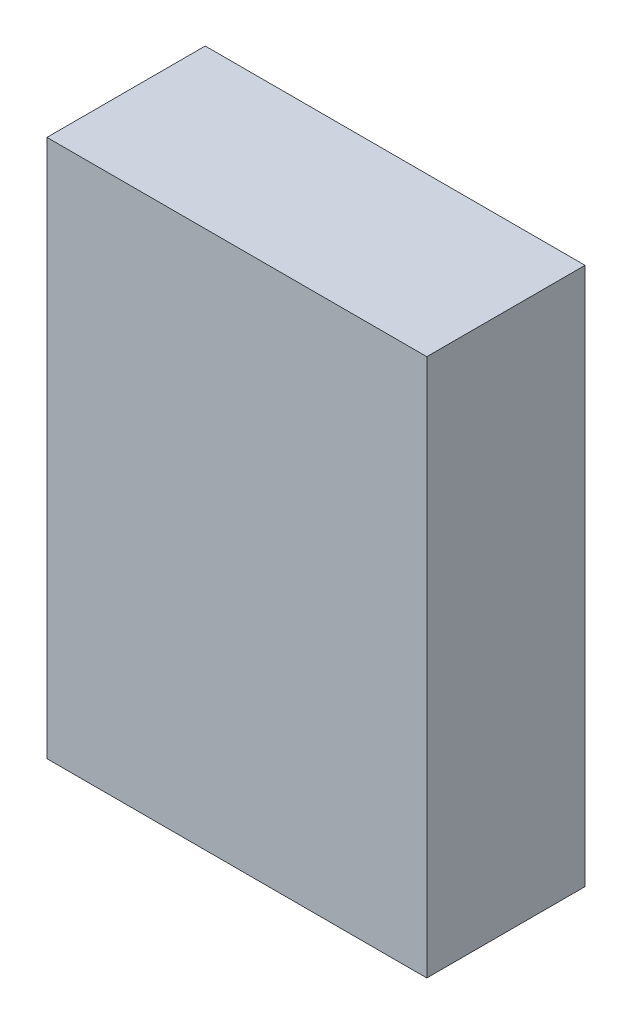
ISO-10303-21;
HEADER;
FILE_DESCRIPTION(('STEP AP214'),'2;1');
FILE_NAME('part.step','',(''),(''),'','','');
FILE_SCHEMA(('AUTOMOTIVE_DESIGN { 1 0 10303 214 1 1 1 1 }'));
ENDSEC;
DATA;
#1=APPLICATION_CONTEXT('core data for automotive mechanical design processes');
#2=APPLICATION_PROTOCOL_DEFINITION('international standard','automotive_design',2000,#1);
#3=PRODUCT_CONTEXT('',#1,'mechanical');
#4=PRODUCT('Part','Part','',(#3));
#5=PRODUCT_RELATED_PRODUCT_CATEGORY('part','',(#4));
#6=PRODUCT_DEFINITION_FORMATION('','',#4);
#7=PRODUCT_DEFINITION_CONTEXT('part definition',#1,'design');
#8=PRODUCT_DEFINITION('design','',#6,#7);
#9=PRODUCT_DEFINITION_SHAPE('','',#8);
#10=(LENGTH_UNIT() NAMED_UNIT(*) SI_UNIT(.MILLI.,.METRE.));
#11=(NAMED_UNIT(*) PLANE_ANGLE_UNIT() SI_UNIT($,.RADIAN.));
#12=(NAMED_UNIT(*) SI_UNIT($,.STERADIAN.) SOLID_ANGLE_UNIT());
#13=UNCERTAINTY_MEASURE_WITH_UNIT(LENGTH_MEASURE(1.E-05),#10,'distance_accuracy_value','');
#14=(GEOMETRIC_REPRESENTATION_CONTEXT(3) GLOBAL_UNCERTAINTY_ASSIGNED_CONTEXT((#13)) GLOBAL_UNIT_ASSIGNED_CONTEXT((#10,
#11,#12)) REPRESENTATION_CONTEXT('',''));
#15=CARTESIAN_POINT('',(0.,0.,0.));
#16=DIRECTION('',(0.,0.,1.));
#17=DIRECTION('',(1.,0.,0.));
#18=AXIS2_PLACEMENT_3D('',#15,#16,#17);
#19=CARTESIAN_POINT('',(-1.87,2.58,0.));
#20=DIRECTION('',(1.,0.,0.));
#21=DIRECTION('',(0.,0.,1.));
#22=AXIS2_PLACEMENT_3D('',#19,#20,#21);
#23=PLANE('',#22);
#24=DIRECTION('',(0.,1.,0.));
#25=VECTOR('',#24,1.);
#26=CARTESIAN_POINT('',(-1.87,2.58,0.1));
#27=LINE('',#26,#25);
#28=CARTESIAN_POINT('',(-1.87,2.58,0.1));
#29=VERTEX_POINT('',#28);
#30=CARTESIAN_POINT('',(-1.87,2.92,0.1));
#31=VERTEX_POINT('',#30);
#32=EDGE_CURVE('E11',#29,#31,#27,.T.);
#33=ORIENTED_EDGE('',*,*,#32,.T.);
#34=DIRECTION('',(0.,0.,1.));
#35=VECTOR('',#34,1.);
#36=CARTESIAN_POINT('',(-1.87,2.92,0.));
#37=LINE('',#36,#35);
#38=CARTESIAN_POINT('',(-1.87,2.92,0.));
#39=VERTEX_POINT('',#38);
#40=EDGE_CURVE('E24',#39,#31,#37,.T.);
#41=ORIENTED_EDGE('',*,*,#40,.F.);
#42=DIRECTION('',(0.,1.,0.));
#43=VECTOR('',#42,1.);
#44=CARTESIAN_POINT('',(-1.87,2.58,0.));
#45=LINE('',#44,#43);
#46=CARTESIAN_POINT('',(-1.87,2.58,0.));
#47=VERTEX_POINT('',#46);
#48=EDGE_CURVE('E86',#47,#39,#45,.T.);
#49=ORIENTED_EDGE('',*,*,#48,.F.);
#50=DIRECTION('',(0.,0.,1.));
#51=VECTOR('',#50,1.);
#52=CARTESIAN_POINT('',(-1.87,2.58,0.));
#53=LINE('',#52,#51);
#54=EDGE_CURVE('E36',#47,#29,#53,.T.);
#55=ORIENTED_EDGE('',*,*,#54,.T.);
#56=EDGE_LOOP('',(#33,#41,#49,#55));
#57=FACE_BOUND('',#56,.T.);
#58=ADVANCED_FACE('F17',(#57),#23,.F.);
#59=CARTESIAN_POINT('',(-1.63,2.58,0.));
#60=DIRECTION('',(1.,0.,0.));
#61=DIRECTION('',(0.,0.,1.));
#62=AXIS2_PLACEMENT_3D('',#59,#60,#61);
#63=PLANE('',#62);
#64=DIRECTION('',(0.,0.,1.));
#65=VECTOR('',#64,1.);
#66=CARTESIAN_POINT('',(-1.63,2.58,0.));
#67=LINE('',#66,#65);
#68=CARTESIAN_POINT('',(-1.63,2.58,0.));
#69=VERTEX_POINT('',#68);
#70=CARTESIAN_POINT('',(-1.63,2.58,0.1));
#71=VERTEX_POINT('',#70);
#72=EDGE_CURVE('E83',#69,#71,#67,.T.);
#73=ORIENTED_EDGE('',*,*,#72,.F.);
#74=DIRECTION('',(0.,1.,0.));
#75=VECTOR('',#74,1.);
#76=CARTESIAN_POINT('',(-1.63,2.58,0.));
#77=LINE('',#76,#75);
#78=CARTESIAN_POINT('',(-1.63,2.92,0.));
#79=VERTEX_POINT('',#78);
#80=EDGE_CURVE('E63',#69,#79,#77,.T.);
#81=ORIENTED_EDGE('',*,*,#80,.T.);
#82=DIRECTION('',(0.,0.,1.));
#83=VECTOR('',#82,1.);
#84=CARTESIAN_POINT('',(-1.63,2.92,0.));
#85=LINE('',#84,#83);
#86=CARTESIAN_POINT('',(-1.63,2.92,0.1));
#87=VERTEX_POINT('',#86);
#88=EDGE_CURVE('E57',#79,#87,#85,.T.);
#89=ORIENTED_EDGE('',*,*,#88,.T.);
#90=DIRECTION('',(0.,1.,0.));
#91=VECTOR('',#90,1.);
#92=CARTESIAN_POINT('',(-1.63,2.58,0.1));
#93=LINE('',#92,#91);
#94=EDGE_CURVE('E60',#71,#87,#93,.T.);
#95=ORIENTED_EDGE('',*,*,#94,.F.);
#96=EDGE_LOOP('',(#73,#81,#89,#95));
#97=FACE_BOUND('',#96,.T.);
#98=ADVANCED_FACE('F59',(#97),#63,.T.);
#99=CARTESIAN_POINT('',(-1.87,2.58,0.));
#100=DIRECTION('',(0.,1.,0.));
#101=DIRECTION('',(0.,0.,1.));
#102=AXIS2_PLACEMENT_3D('',#99,#100,#101);
#103=PLANE('',#102);
#104=ORIENTED_EDGE('',*,*,#72,.T.);
#105=DIRECTION('',(1.,0.,0.));
#106=VECTOR('',#105,1.);
#107=CARTESIAN_POINT('',(-1.87,2.58,0.1));
#108=LINE('',#107,#106);
#109=EDGE_CURVE('E71',#29,#71,#108,.T.);
#110=ORIENTED_EDGE('',*,*,#109,.F.);
#111=ORIENTED_EDGE('',*,*,#54,.F.);
#112=DIRECTION('',(1.,0.,0.));
#113=VECTOR('',#112,1.);
#114=CARTESIAN_POINT('',(-1.87,2.58,0.));
#115=LINE('',#114,#113);
#116=EDGE_CURVE('E76',#47,#69,#115,.T.);
#117=ORIENTED_EDGE('',*,*,#116,.T.);
#118=EDGE_LOOP('',(#104,#110,#111,#117));
#119=FACE_BOUND('',#118,.T.);
#120=ADVANCED_FACE('F91',(#119),#103,.F.);
#121=CARTESIAN_POINT('',(-1.87,2.92,0.));
#122=DIRECTION('',(0.,1.,0.));
#123=DIRECTION('',(0.,0.,1.));
#124=AXIS2_PLACEMENT_3D('',#121,#122,#123);
#125=PLANE('',#124);
#126=DIRECTION('',(1.,0.,0.));
#127=VECTOR('',#126,1.);
#128=CARTESIAN_POINT('',(-1.87,2.92,0.));
#129=LINE('',#128,#127);
#130=EDGE_CURVE('E74',#39,#79,#129,.T.);
#131=ORIENTED_EDGE('',*,*,#130,.F.);
#132=ORIENTED_EDGE('',*,*,#40,.T.);
#133=DIRECTION('',(1.,0.,0.));
#134=VECTOR('',#133,1.);
#135=CARTESIAN_POINT('',(-1.87,2.92,0.1));
#136=LINE('',#135,#134);
#137=EDGE_CURVE('E69',#31,#87,#136,.T.);
#138=ORIENTED_EDGE('',*,*,#137,.T.);
#139=ORIENTED_EDGE('',*,*,#88,.F.);
#140=EDGE_LOOP('',(#131,#132,#138,#139));
#141=FACE_BOUND('',#140,.T.);
#142=ADVANCED_FACE('F73',(#141),#125,.T.);
#143=CARTESIAN_POINT('',(-1.87,2.58,0.));
#144=DIRECTION('',(0.,0.,1.));
#145=DIRECTION('',(1.,0.,0.));
#146=AXIS2_PLACEMENT_3D('',#143,#144,#145);
#147=PLANE('',#146);
#148=ORIENTED_EDGE('',*,*,#130,.T.);
#149=ORIENTED_EDGE('',*,*,#80,.F.);
#150=ORIENTED_EDGE('',*,*,#116,.F.);
#151=ORIENTED_EDGE('',*,*,#48,.T.);
#152=EDGE_LOOP('',(#148,#149,#150,#151));
#153=FACE_BOUND('',#152,.T.);
#154=ADVANCED_FACE('F89',(#153),#147,.F.);
#155=CARTESIAN_POINT('',(-1.87,2.58,0.1));
#156=DIRECTION('',(0.,0.,1.));
#157=DIRECTION('',(1.,0.,0.));
#158=AXIS2_PLACEMENT_3D('',#155,#156,#157);
#159=PLANE('',#158);
#160=ORIENTED_EDGE('',*,*,#32,.F.);
#161=ORIENTED_EDGE('',*,*,#109,.T.);
#162=ORIENTED_EDGE('',*,*,#94,.T.);
#163=ORIENTED_EDGE('',*,*,#137,.F.);
#164=EDGE_LOOP('',(#160,#161,#162,#163));
#165=FACE_BOUND('',#164,.T.);
#166=ADVANCED_FACE('F68',(#165),#159,.T.);
#167=CLOSED_SHELL('',(#58,#98,#120,#142,#154,#166));
#168=MANIFOLD_SOLID_BREP('B1',#167);
#169=ADVANCED_BREP_SHAPE_REPRESENTATION('',(#18,#168),#14);
#170=SHAPE_DEFINITION_REPRESENTATION(#9,#169);
ENDSEC;
END-ISO-10303-21;
